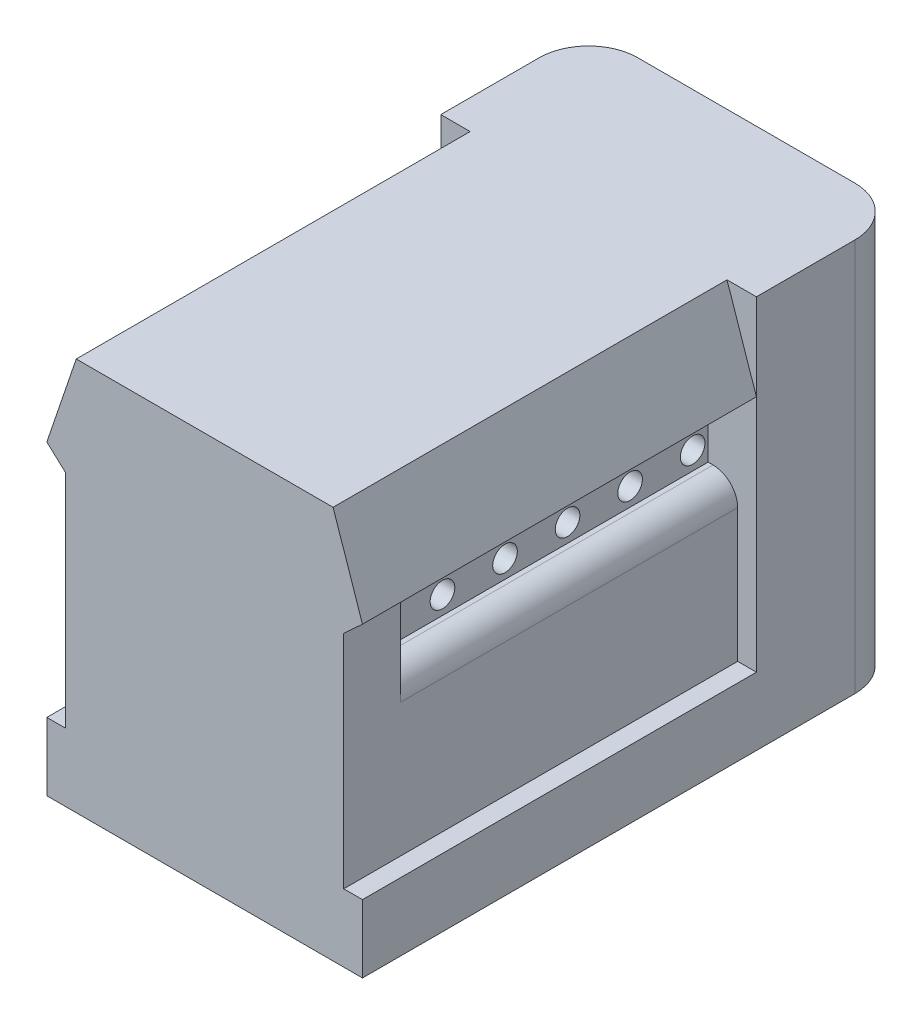
ISO-10303-21;
HEADER;
FILE_DESCRIPTION(('STEP AP214'),'2;1');
FILE_NAME('part.step','',(''),(''),'','','');
FILE_SCHEMA(('AUTOMOTIVE_DESIGN { 1 0 10303 214 1 1 1 1 }'));
ENDSEC;
DATA;
#1=APPLICATION_CONTEXT('core data for automotive mechanical design processes');
#2=APPLICATION_PROTOCOL_DEFINITION('international standard','automotive_design',2000,#1);
#3=PRODUCT_CONTEXT('',#1,'mechanical');
#4=PRODUCT('Part','Part','',(#3));
#5=PRODUCT_RELATED_PRODUCT_CATEGORY('part','',(#4));
#6=PRODUCT_DEFINITION_FORMATION('','',#4);
#7=PRODUCT_DEFINITION_CONTEXT('part definition',#1,'design');
#8=PRODUCT_DEFINITION('design','',#6,#7);
#9=PRODUCT_DEFINITION_SHAPE('','',#8);
#10=(LENGTH_UNIT() NAMED_UNIT(*) SI_UNIT(.MILLI.,.METRE.));
#11=(NAMED_UNIT(*) PLANE_ANGLE_UNIT() SI_UNIT($,.RADIAN.));
#12=(NAMED_UNIT(*) SI_UNIT($,.STERADIAN.) SOLID_ANGLE_UNIT());
#13=UNCERTAINTY_MEASURE_WITH_UNIT(LENGTH_MEASURE(1.E-05),#10,'distance_accuracy_value','');
#14=(GEOMETRIC_REPRESENTATION_CONTEXT(3) GLOBAL_UNCERTAINTY_ASSIGNED_CONTEXT((#13)) GLOBAL_UNIT_ASSIGNED_CONTEXT((#10,
#11,#12)) REPRESENTATION_CONTEXT('',''));
#15=CARTESIAN_POINT('',(0.,0.,0.));
#16=DIRECTION('',(0.,0.,1.));
#17=DIRECTION('',(1.,0.,0.));
#18=AXIS2_PLACEMENT_3D('',#15,#16,#17);
#19=CARTESIAN_POINT('',(0.,0.,16.));
#20=DIRECTION('',(0.,1.,0.));
#21=DIRECTION('',(-1.,0.,0.));
#22=AXIS2_PLACEMENT_3D('',#19,#20,#21);
#23=PLANE('',#22);
#24=CARTESIAN_POINT('',(-2.5476427621849,0.,-4.45));
#25=DIRECTION('',(0.,1.,0.));
#26=DIRECTION('',(-1.,0.,0.));
#27=AXIS2_PLACEMENT_3D('',#24,#25,#26);
#28=CIRCLE('',#27,0.4);
#29=CARTESIAN_POINT('',(-2.9476427621849,0.,-4.45));
#30=VERTEX_POINT('',#29);
#31=EDGE_CURVE('E40',#30,#30,#28,.F.);
#32=ORIENTED_EDGE('',*,*,#31,.F.);
#33=EDGE_LOOP('',(#32));
#34=FACE_BOUND('',#33,.T.);
#35=DIRECTION('',(0.,0.,-1.));
#36=VECTOR('',#35,1.);
#37=CARTESIAN_POINT('',(6.41,0.,16.));
#38=LINE('',#37,#36);
#39=CARTESIAN_POINT('',(6.41,0.,16.));
#40=VERTEX_POINT('',#39);
#41=CARTESIAN_POINT('',(6.41,0.,-4.));
#42=VERTEX_POINT('',#41);
#43=EDGE_CURVE('E371',#40,#42,#38,.T.);
#44=ORIENTED_EDGE('',*,*,#43,.F.);
#45=DIRECTION('',(1.,0.,0.));
#46=VECTOR('',#45,1.);
#47=CARTESIAN_POINT('',(0.,0.,16.));
#48=LINE('',#47,#46);
#49=CARTESIAN_POINT('',(-6.41,0.,16.));
#50=VERTEX_POINT('',#49);
#51=EDGE_CURVE('E304',#50,#40,#48,.T.);
#52=ORIENTED_EDGE('',*,*,#51,.F.);
#53=DIRECTION('',(0.,0.,-1.));
#54=VECTOR('',#53,1.);
#55=CARTESIAN_POINT('',(-6.41,0.,16.));
#56=LINE('',#55,#54);
#57=CARTESIAN_POINT('',(-6.41,0.,-4.));
#58=VERTEX_POINT('',#57);
#59=EDGE_CURVE('E330',#50,#58,#56,.T.);
#60=ORIENTED_EDGE('',*,*,#59,.T.);
#61=CARTESIAN_POINT('',(-4.41,0.,-4.));
#62=DIRECTION('',(0.,1.,0.));
#63=DIRECTION('',(-1.,0.,0.));
#64=AXIS2_PLACEMENT_3D('',#61,#62,#63);
#65=CIRCLE('',#64,2.);
#66=CARTESIAN_POINT('',(-4.41,0.,-6.));
#67=VERTEX_POINT('',#66);
#68=EDGE_CURVE('E253',#58,#67,#65,.F.);
#69=ORIENTED_EDGE('',*,*,#68,.T.);
#70=DIRECTION('',(1.,0.,0.));
#71=VECTOR('',#70,1.);
#72=CARTESIAN_POINT('',(-4.41,0.,-6.));
#73=LINE('',#72,#71);
#74=CARTESIAN_POINT('',(4.41,0.,-6.));
#75=VERTEX_POINT('',#74);
#76=EDGE_CURVE('E251',#67,#75,#73,.T.);
#77=ORIENTED_EDGE('',*,*,#76,.T.);
#78=CARTESIAN_POINT('',(4.41,0.,-4.));
#79=DIRECTION('',(0.,1.,0.));
#80=DIRECTION('',(-1.,0.,0.));
#81=AXIS2_PLACEMENT_3D('',#78,#79,#80);
#82=CIRCLE('',#81,2.);
#83=EDGE_CURVE('E256',#75,#42,#82,.F.);
#84=ORIENTED_EDGE('',*,*,#83,.T.);
#85=EDGE_LOOP('',(#44,#52,#60,#69,#77,#84));
#86=FACE_BOUND('',#85,.T.);
#87=CARTESIAN_POINT('',(-0.00764276218490068,0.,-4.45));
#88=DIRECTION('',(0.,1.,0.));
#89=DIRECTION('',(-1.,0.,0.));
#90=AXIS2_PLACEMENT_3D('',#87,#88,#89);
#91=CIRCLE('',#90,0.4);
#92=CARTESIAN_POINT('',(-0.407642762184901,0.,-4.45));
#93=VERTEX_POINT('',#92);
#94=EDGE_CURVE('E393',#93,#93,#91,.F.);
#95=ORIENTED_EDGE('',*,*,#94,.F.);
#96=EDGE_LOOP('',(#95));
#97=FACE_BOUND('',#96,.T.);
#98=CARTESIAN_POINT('',(2.5476427621849,0.,-4.45));
#99=DIRECTION('',(0.,1.,0.));
#100=DIRECTION('',(-1.,0.,0.));
#101=AXIS2_PLACEMENT_3D('',#98,#99,#100);
#102=CIRCLE('',#101,0.4);
#103=CARTESIAN_POINT('',(2.1476427621849,0.,-4.45));
#104=VERTEX_POINT('',#103);
#105=EDGE_CURVE('E11',#104,#104,#102,.F.);
#106=ORIENTED_EDGE('',*,*,#105,.F.);
#107=EDGE_LOOP('',(#106));
#108=FACE_BOUND('',#107,.T.);
#109=ADVANCED_FACE('F32',(#34,#86,#97,#108),#23,.F.);
#110=CARTESIAN_POINT('',(6.41,0.,16.));
#111=DIRECTION('',(-1.,0.,0.));
#112=DIRECTION('',(0.,-1.,0.));
#113=AXIS2_PLACEMENT_3D('',#110,#111,#112);
#114=PLANE('',#113);
#115=ORIENTED_EDGE('',*,*,#43,.T.);
#116=DIRECTION('',(0.,1.,0.));
#117=VECTOR('',#116,1.);
#118=CARTESIAN_POINT('',(6.41,-14.1545893617583,-4.));
#119=LINE('',#118,#117);
#120=CARTESIAN_POINT('',(6.41,15.9608859734106,-4.));
#121=VERTEX_POINT('',#120);
#122=EDGE_CURVE('E283',#42,#121,#119,.T.);
#123=ORIENTED_EDGE('',*,*,#122,.T.);
#124=DIRECTION('',(0.,0.,-1.));
#125=VECTOR('',#124,1.);
#126=CARTESIAN_POINT('',(6.41,15.9608859734106,0.));
#127=LINE('',#126,#125);
#128=CARTESIAN_POINT('',(6.41,15.9608859734106,0.));
#129=VERTEX_POINT('',#128);
#130=EDGE_CURVE('E250',#129,#121,#127,.T.);
#131=ORIENTED_EDGE('',*,*,#130,.F.);
#132=DIRECTION('',(0.,1.,0.));
#133=VECTOR('',#132,1.);
#134=CARTESIAN_POINT('',(6.41,-14.1545893617583,0.));
#135=LINE('',#134,#133);
#136=CARTESIAN_POINT('',(6.41,12.4441681952855,0.));
#137=VERTEX_POINT('',#136);
#138=EDGE_CURVE('E284',#137,#129,#135,.T.);
#139=ORIENTED_EDGE('',*,*,#138,.F.);
#140=CARTESIAN_POINT('',(6.41,2.75660601403546,0.));
#141=VERTEX_POINT('',#140);
#142=EDGE_CURVE('E254',#141,#137,#135,.T.);
#143=ORIENTED_EDGE('',*,*,#142,.F.);
#144=DIRECTION('',(0.,0.,-1.));
#145=VECTOR('',#144,1.);
#146=CARTESIAN_POINT('',(6.41,2.75660601403546,16.));
#147=LINE('',#146,#145);
#148=CARTESIAN_POINT('',(6.41,2.75660601403546,16.));
#149=VERTEX_POINT('',#148);
#150=EDGE_CURVE('E368',#149,#141,#147,.T.);
#151=ORIENTED_EDGE('',*,*,#150,.F.);
#152=DIRECTION('',(0.,1.,0.));
#153=VECTOR('',#152,1.);
#154=CARTESIAN_POINT('',(6.41,0.,16.));
#155=LINE('',#154,#153);
#156=EDGE_CURVE('E306',#40,#149,#155,.T.);
#157=ORIENTED_EDGE('',*,*,#156,.F.);
#158=EDGE_LOOP('',(#115,#123,#131,#139,#143,#151,#157));
#159=FACE_BOUND('',#158,.T.);
#160=ADVANCED_FACE('F402',(#159),#114,.F.);
#161=CARTESIAN_POINT('',(6.41,2.75660601403546,16.));
#162=DIRECTION('',(0.,-1.,0.));
#163=DIRECTION('',(0.,0.,-1.));
#164=AXIS2_PLACEMENT_3D('',#161,#162,#163);
#165=PLANE('',#164);
#166=DIRECTION('',(-1.,0.,0.));
#167=VECTOR('',#166,1.);
#168=CARTESIAN_POINT('',(6.41,2.75660601403546,0.));
#169=LINE('',#168,#167);
#170=CARTESIAN_POINT('',(5.64930017042915,2.75660601403546,0.));
#171=VERTEX_POINT('',#170);
#172=EDGE_CURVE('E292',#141,#171,#169,.T.);
#173=ORIENTED_EDGE('',*,*,#172,.T.);
#174=DIRECTION('',(0.,0.,-1.));
#175=VECTOR('',#174,1.);
#176=CARTESIAN_POINT('',(5.64930017042915,2.75660601403546,16.));
#177=LINE('',#176,#175);
#178=CARTESIAN_POINT('',(5.64930017042915,2.75660601403546,16.));
#179=VERTEX_POINT('',#178);
#180=EDGE_CURVE('E372',#179,#171,#177,.T.);
#181=ORIENTED_EDGE('',*,*,#180,.F.);
#182=DIRECTION('',(-1.,0.,0.));
#183=VECTOR('',#182,1.);
#184=CARTESIAN_POINT('',(6.41,2.75660601403546,16.));
#185=LINE('',#184,#183);
#186=EDGE_CURVE('E309',#149,#179,#185,.T.);
#187=ORIENTED_EDGE('',*,*,#186,.F.);
#188=ORIENTED_EDGE('',*,*,#150,.T.);
#189=EDGE_LOOP('',(#173,#181,#187,#188));
#190=FACE_BOUND('',#189,.T.);
#191=ADVANCED_FACE('F526',(#190),#165,.F.);
#192=CARTESIAN_POINT('',(5.64930017042915,8.1646618499226,16.));
#193=DIRECTION('',(-1.,0.,0.));
#194=DIRECTION('',(0.,0.,1.));
#195=AXIS2_PLACEMENT_3D('',#192,#193,#194);
#196=PLANE('',#195);
#197=DIRECTION('',(0.,0.,-1.));
#198=VECTOR('',#197,1.);
#199=CARTESIAN_POINT('',(5.64930017042914,8.1646618499226,16.));
#200=LINE('',#199,#198);
#201=CARTESIAN_POINT('',(5.64930017042914,8.1646618499226,13.7));
#202=VERTEX_POINT('',#201);
#203=CARTESIAN_POINT('',(5.64930017042914,8.1646618499226,0.));
#204=VERTEX_POINT('',#203);
#205=EDGE_CURVE('E213',#202,#204,#200,.T.);
#206=ORIENTED_EDGE('',*,*,#205,.F.);
#207=DIRECTION('',(0.,-1.,0.));
#208=VECTOR('',#207,1.);
#209=CARTESIAN_POINT('',(5.64930017042914,13.,13.7));
#210=LINE('',#209,#208);
#211=CARTESIAN_POINT('',(5.64930017042914,11.7445753651986,13.7));
#212=VERTEX_POINT('',#211);
#213=EDGE_CURVE('E198',#212,#202,#210,.T.);
#214=ORIENTED_EDGE('',*,*,#213,.F.);
#215=DIRECTION('',(0.,0.,-1.));
#216=VECTOR('',#215,1.);
#217=CARTESIAN_POINT('',(5.64930017042914,11.7445753651986,16.));
#218=LINE('',#217,#216);
#219=CARTESIAN_POINT('',(5.64930017042914,11.7445753651986,16.));
#220=VERTEX_POINT('',#219);
#221=EDGE_CURVE('E210',#220,#212,#218,.T.);
#222=ORIENTED_EDGE('',*,*,#221,.F.);
#223=DIRECTION('',(0.,1.,0.));
#224=VECTOR('',#223,1.);
#225=CARTESIAN_POINT('',(5.64930017042915,8.1646618499226,16.));
#226=LINE('',#225,#224);
#227=EDGE_CURVE('E311',#179,#220,#226,.T.);
#228=ORIENTED_EDGE('',*,*,#227,.F.);
#229=ORIENTED_EDGE('',*,*,#180,.T.);
#230=DIRECTION('',(0.,1.,0.));
#231=VECTOR('',#230,1.);
#232=CARTESIAN_POINT('',(5.64930017042915,8.1646618499226,0.));
#233=LINE('',#232,#231);
#234=EDGE_CURVE('E331',#171,#204,#233,.T.);
#235=ORIENTED_EDGE('',*,*,#234,.T.);
#236=EDGE_LOOP('',(#206,#214,#222,#228,#229,#235));
#237=FACE_BOUND('',#236,.T.);
#238=ADVANCED_FACE('F208',(#237),#196,.F.);
#239=CARTESIAN_POINT('',(4.64930017042914,8.1646618499226,16.));
#240=DIRECTION('',(0.,0.,-1.));
#241=DIRECTION('',(-1.,0.,0.));
#242=AXIS2_PLACEMENT_3D('',#239,#240,#241);
#243=CYLINDRICAL_SURFACE('',#242,1.);
#244=CARTESIAN_POINT('',(4.64930017042914,8.1646618499226,13.7));
#245=DIRECTION('',(0.,0.,-1.));
#246=DIRECTION('',(-1.,0.,0.));
#247=AXIS2_PLACEMENT_3D('',#244,#245,#246);
#248=CIRCLE('',#247,1.);
#249=CARTESIAN_POINT('',(4.64930017042914,9.16466184992259,13.7));
#250=VERTEX_POINT('',#249);
#251=EDGE_CURVE('E236',#250,#202,#248,.T.);
#252=ORIENTED_EDGE('',*,*,#251,.T.);
#253=ORIENTED_EDGE('',*,*,#205,.T.);
#254=CARTESIAN_POINT('',(4.64930017042914,8.1646618499226,0.));
#255=DIRECTION('',(0.,0.,1.));
#256=DIRECTION('',(-1.,0.,0.));
#257=AXIS2_PLACEMENT_3D('',#254,#255,#256);
#258=CIRCLE('',#257,1.);
#259=CARTESIAN_POINT('',(4.64930017042914,9.16466184992259,0.));
#260=VERTEX_POINT('',#259);
#261=EDGE_CURVE('E333',#204,#260,#258,.T.);
#262=ORIENTED_EDGE('',*,*,#261,.T.);
#263=DIRECTION('',(0.,0.,-1.));
#264=VECTOR('',#263,1.);
#265=CARTESIAN_POINT('',(4.64930017042914,9.16466184992259,16.));
#266=LINE('',#265,#264);
#267=EDGE_CURVE('E580',#250,#260,#266,.T.);
#268=ORIENTED_EDGE('',*,*,#267,.F.);
#269=EDGE_LOOP('',(#252,#253,#262,#268));
#270=FACE_BOUND('',#269,.T.);
#271=ADVANCED_FACE('F519',(#270),#243,.T.);
#272=CARTESIAN_POINT('',(4.44930017042915,9.16466184992259,16.));
#273=DIRECTION('',(0.,-1.,0.));
#274=DIRECTION('',(0.,0.,-1.));
#275=AXIS2_PLACEMENT_3D('',#272,#273,#274);
#276=PLANE('',#275);
#277=DIRECTION('',(0.,0.,-1.));
#278=VECTOR('',#277,1.);
#279=CARTESIAN_POINT('',(4.44930017042915,9.16466184992259,16.));
#280=LINE('',#279,#278);
#281=CARTESIAN_POINT('',(4.44930017042915,9.16466184992259,13.7));
#282=VERTEX_POINT('',#281);
#283=CARTESIAN_POINT('',(4.44930017042915,9.16466184992259,0.));
#284=VERTEX_POINT('',#283);
#285=EDGE_CURVE('E578',#282,#284,#280,.T.);
#286=ORIENTED_EDGE('',*,*,#285,.F.);
#287=DIRECTION('',(1.,0.,0.));
#288=VECTOR('',#287,1.);
#289=CARTESIAN_POINT('',(4.44930017042915,9.16466184992259,13.7));
#290=LINE('',#289,#288);
#291=EDGE_CURVE('E233',#282,#250,#290,.T.);
#292=ORIENTED_EDGE('',*,*,#291,.T.);
#293=ORIENTED_EDGE('',*,*,#267,.T.);
#294=DIRECTION('',(-1.,0.,0.));
#295=VECTOR('',#294,1.);
#296=CARTESIAN_POINT('',(4.44930017042915,9.16466184992259,0.));
#297=LINE('',#296,#295);
#298=EDGE_CURVE('E336',#260,#284,#297,.T.);
#299=ORIENTED_EDGE('',*,*,#298,.T.);
#300=EDGE_LOOP('',(#286,#292,#293,#299));
#301=FACE_BOUND('',#300,.T.);
#302=ADVANCED_FACE('F515',(#301),#276,.F.);
#303=CARTESIAN_POINT('',(4.44930017042915,10.6409713370789,16.));
#304=DIRECTION('',(-1.,0.,0.));
#305=DIRECTION('',(0.,0.,1.));
#306=AXIS2_PLACEMENT_3D('',#303,#304,#305);
#307=PLANE('',#306);
#308=CARTESIAN_POINT('',(4.44930017042915,9.90281659350076,3.17));
#309=DIRECTION('',(-1.,0.,0.));
#310=DIRECTION('',(0.,0.,1.));
#311=AXIS2_PLACEMENT_3D('',#308,#309,#310);
#312=CIRCLE('',#311,0.5);
#313=CARTESIAN_POINT('',(4.44930017042915,9.90281659350076,3.67));
#314=VERTEX_POINT('',#313);
#315=EDGE_CURVE('E241',#314,#314,#312,.F.);
#316=ORIENTED_EDGE('',*,*,#315,.F.);
#317=EDGE_LOOP('',(#316));
#318=FACE_BOUND('',#317,.T.);
#319=CARTESIAN_POINT('',(4.44930017042915,9.90281659350076,0.63));
#320=DIRECTION('',(-1.,0.,0.));
#321=DIRECTION('',(0.,0.,1.));
#322=AXIS2_PLACEMENT_3D('',#319,#320,#321);
#323=CIRCLE('',#322,0.5);
#324=CARTESIAN_POINT('',(4.44930017042915,9.90281659350076,1.13));
#325=VERTEX_POINT('',#324);
#326=EDGE_CURVE('E247',#325,#325,#323,.F.);
#327=ORIENTED_EDGE('',*,*,#326,.F.);
#328=EDGE_LOOP('',(#327));
#329=FACE_BOUND('',#328,.T.);
#330=DIRECTION('',(0.,0.,-1.));
#331=VECTOR('',#330,1.);
#332=CARTESIAN_POINT('',(4.44930017042915,10.6409713370789,16.));
#333=LINE('',#332,#331);
#334=CARTESIAN_POINT('',(4.44930017042915,10.6409713370789,13.7));
#335=VERTEX_POINT('',#334);
#336=CARTESIAN_POINT('',(4.44930017042915,10.6409713370789,0.));
#337=VERTEX_POINT('',#336);
#338=EDGE_CURVE('E576',#335,#337,#333,.T.);
#339=ORIENTED_EDGE('',*,*,#338,.F.);
#340=DIRECTION('',(0.,-1.,0.));
#341=VECTOR('',#340,1.);
#342=CARTESIAN_POINT('',(4.44930017042915,10.6409713370789,13.7));
#343=LINE('',#342,#341);
#344=EDGE_CURVE('E201',#335,#282,#343,.T.);
#345=ORIENTED_EDGE('',*,*,#344,.T.);
#346=ORIENTED_EDGE('',*,*,#285,.T.);
#347=DIRECTION('',(0.,1.,0.));
#348=VECTOR('',#347,1.);
#349=CARTESIAN_POINT('',(4.44930017042915,10.6409713370789,0.));
#350=LINE('',#349,#348);
#351=EDGE_CURVE('E339',#284,#337,#350,.T.);
#352=ORIENTED_EDGE('',*,*,#351,.T.);
#353=EDGE_LOOP('',(#339,#345,#346,#352));
#354=FACE_BOUND('',#353,.T.);
#355=CARTESIAN_POINT('',(4.44930017042915,9.90281659350076,5.71));
#356=DIRECTION('',(-1.,0.,0.));
#357=DIRECTION('',(0.,0.,1.));
#358=AXIS2_PLACEMENT_3D('',#355,#356,#357);
#359=CIRCLE('',#358,0.5);
#360=CARTESIAN_POINT('',(4.44930017042915,9.90281659350076,6.21));
#361=VERTEX_POINT('',#360);
#362=EDGE_CURVE('E378',#361,#361,#359,.F.);
#363=ORIENTED_EDGE('',*,*,#362,.F.);
#364=EDGE_LOOP('',(#363));
#365=FACE_BOUND('',#364,.T.);
#366=CARTESIAN_POINT('',(4.44930017042915,9.90281659350076,8.25));
#367=DIRECTION('',(-1.,0.,0.));
#368=DIRECTION('',(0.,0.,1.));
#369=AXIS2_PLACEMENT_3D('',#366,#367,#368);
#370=CIRCLE('',#369,0.5);
#371=CARTESIAN_POINT('',(4.44930017042915,9.90281659350076,8.75));
#372=VERTEX_POINT('',#371);
#373=EDGE_CURVE('E384',#372,#372,#370,.F.);
#374=ORIENTED_EDGE('',*,*,#373,.F.);
#375=EDGE_LOOP('',(#374));
#376=FACE_BOUND('',#375,.T.);
#377=CARTESIAN_POINT('',(4.44930017042915,9.90281659350076,10.79));
#378=DIRECTION('',(-1.,0.,0.));
#379=DIRECTION('',(0.,0.,1.));
#380=AXIS2_PLACEMENT_3D('',#377,#378,#379);
#381=CIRCLE('',#380,0.5);
#382=CARTESIAN_POINT('',(4.44930017042915,9.90281659350076,11.29));
#383=VERTEX_POINT('',#382);
#384=EDGE_CURVE('E390',#383,#383,#381,.F.);
#385=ORIENTED_EDGE('',*,*,#384,.F.);
#386=EDGE_LOOP('',(#385));
#387=FACE_BOUND('',#386,.T.);
#388=ADVANCED_FACE('F512',(#318,#329,#354,#365,#376,#387),#307,.F.);
#389=CARTESIAN_POINT('',(4.44930017042915,10.6409713370789,16.));
#390=DIRECTION('',(-0.676924977588465,0.736052019029129,0.));
#391=DIRECTION('',(-0.736052019029129,-0.676924977588465,0.));
#392=AXIS2_PLACEMENT_3D('',#389,#390,#391);
#393=PLANE('',#392);
#394=DIRECTION('',(0.736052019029129,0.676924977588465,0.));
#395=VECTOR('',#394,1.);
#396=CARTESIAN_POINT('',(4.44930017042915,10.6409713370789,16.));
#397=LINE('',#396,#395);
#398=CARTESIAN_POINT('',(6.41,12.4441681952855,16.));
#399=VERTEX_POINT('',#398);
#400=EDGE_CURVE('E218',#220,#399,#397,.T.);
#401=ORIENTED_EDGE('',*,*,#400,.F.);
#402=ORIENTED_EDGE('',*,*,#221,.T.);
#403=DIRECTION('',(-0.736052019029129,-0.676924977588465,0.));
#404=VECTOR('',#403,1.);
#405=CARTESIAN_POINT('',(4.44930017042915,10.6409713370789,13.7));
#406=LINE('',#405,#404);
#407=EDGE_CURVE('E195',#212,#335,#406,.T.);
#408=ORIENTED_EDGE('',*,*,#407,.T.);
#409=ORIENTED_EDGE('',*,*,#338,.T.);
#410=DIRECTION('',(0.736052019029129,0.676924977588465,0.));
#411=VECTOR('',#410,1.);
#412=CARTESIAN_POINT('',(4.44930017042915,10.6409713370789,0.));
#413=LINE('',#412,#411);
#414=EDGE_CURVE('E342',#337,#137,#413,.T.);
#415=ORIENTED_EDGE('',*,*,#414,.T.);
#416=DIRECTION('',(0.,0.,-1.));
#417=VECTOR('',#416,1.);
#418=CARTESIAN_POINT('',(6.41,12.4441681952855,16.));
#419=LINE('',#418,#417);
#420=EDGE_CURVE('E360',#399,#137,#419,.T.);
#421=ORIENTED_EDGE('',*,*,#420,.F.);
#422=EDGE_LOOP('',(#401,#402,#408,#409,#415,#421));
#423=FACE_BOUND('',#422,.T.);
#424=ADVANCED_FACE('F216',(#423),#393,.F.);
#425=CARTESIAN_POINT('',(6.41,12.4441681952855,16.));
#426=DIRECTION('',(-0.946881588720455,-0.32158242635789,0.));
#427=DIRECTION('',(0.32158242635789,-0.946881588720455,0.));
#428=AXIS2_PLACEMENT_3D('',#425,#426,#427);
#429=PLANE('',#428);
#430=DIRECTION('',(-0.32158242635789,0.946881588720455,0.));
#431=VECTOR('',#430,1.);
#432=CARTESIAN_POINT('',(6.41,12.4441681952855,0.));
#433=LINE('',#432,#431);
#434=CARTESIAN_POINT('',(5.21564301874999,15.9608859734106,0.));
#435=VERTEX_POINT('',#434);
#436=EDGE_CURVE('E345',#137,#435,#433,.T.);
#437=ORIENTED_EDGE('',*,*,#436,.T.);
#438=DIRECTION('',(0.,0.,-1.));
#439=VECTOR('',#438,1.);
#440=CARTESIAN_POINT('',(5.21564301874999,15.9608859734106,16.));
#441=LINE('',#440,#439);
#442=CARTESIAN_POINT('',(5.21564301874999,15.9608859734106,16.));
#443=VERTEX_POINT('',#442);
#444=EDGE_CURVE('E357',#443,#435,#441,.T.);
#445=ORIENTED_EDGE('',*,*,#444,.F.);
#446=DIRECTION('',(-0.32158242635789,0.946881588720455,0.));
#447=VECTOR('',#446,1.);
#448=CARTESIAN_POINT('',(6.41,12.4441681952855,16.));
#449=LINE('',#448,#447);
#450=EDGE_CURVE('E314',#399,#443,#449,.T.);
#451=ORIENTED_EDGE('',*,*,#450,.F.);
#452=ORIENTED_EDGE('',*,*,#420,.T.);
#453=EDGE_LOOP('',(#437,#445,#451,#452));
#454=FACE_BOUND('',#453,.T.);
#455=ADVANCED_FACE('F505',(#454),#429,.F.);
#456=CARTESIAN_POINT('',(-5.21564301874999,15.9608859734106,16.));
#457=DIRECTION('',(0.,-1.,0.));
#458=DIRECTION('',(0.,0.,-1.));
#459=AXIS2_PLACEMENT_3D('',#456,#457,#458);
#460=PLANE('',#459);
#461=ORIENTED_EDGE('',*,*,#444,.T.);
#462=DIRECTION('',(1.,0.,0.));
#463=VECTOR('',#462,1.);
#464=CARTESIAN_POINT('',(-6.41,15.9608859734106,0.));
#465=LINE('',#464,#463);
#466=EDGE_CURVE('E271',#435,#129,#465,.T.);
#467=ORIENTED_EDGE('',*,*,#466,.T.);
#468=ORIENTED_EDGE('',*,*,#130,.T.);
#469=CARTESIAN_POINT('',(4.41,15.9608859734106,-4.));
#470=DIRECTION('',(0.,1.,0.));
#471=DIRECTION('',(0.,0.,-1.));
#472=AXIS2_PLACEMENT_3D('',#469,#470,#471);
#473=CIRCLE('',#472,2.);
#474=CARTESIAN_POINT('',(4.41,15.9608859734106,-6.));
#475=VERTEX_POINT('',#474);
#476=EDGE_CURVE('E259',#121,#475,#473,.T.);
#477=ORIENTED_EDGE('',*,*,#476,.T.);
#478=DIRECTION('',(-1.,0.,0.));
#479=VECTOR('',#478,1.);
#480=CARTESIAN_POINT('',(-4.41,15.9608859734106,-6.));
#481=LINE('',#480,#479);
#482=CARTESIAN_POINT('',(-4.41,15.9608859734106,-6.));
#483=VERTEX_POINT('',#482);
#484=EDGE_CURVE('E262',#475,#483,#481,.T.);
#485=ORIENTED_EDGE('',*,*,#484,.T.);
#486=CARTESIAN_POINT('',(-4.41,15.9608859734106,-4.));
#487=DIRECTION('',(0.,1.,0.));
#488=DIRECTION('',(0.,0.,1.));
#489=AXIS2_PLACEMENT_3D('',#486,#487,#488);
#490=CIRCLE('',#489,2.);
#491=CARTESIAN_POINT('',(-6.41,15.9608859734106,-4.));
#492=VERTEX_POINT('',#491);
#493=EDGE_CURVE('E265',#483,#492,#490,.T.);
#494=ORIENTED_EDGE('',*,*,#493,.T.);
#495=DIRECTION('',(0.,0.,1.));
#496=VECTOR('',#495,1.);
#497=CARTESIAN_POINT('',(-6.41,15.9608859734106,0.));
#498=LINE('',#497,#496);
#499=CARTESIAN_POINT('',(-6.41,15.9608859734106,0.));
#500=VERTEX_POINT('',#499);
#501=EDGE_CURVE('E268',#492,#500,#498,.T.);
#502=ORIENTED_EDGE('',*,*,#501,.T.);
#503=CARTESIAN_POINT('',(-5.21564301874999,15.9608859734106,0.));
#504=VERTEX_POINT('',#503);
#505=EDGE_CURVE('E280',#500,#504,#465,.T.);
#506=ORIENTED_EDGE('',*,*,#505,.T.);
#507=DIRECTION('',(0.,0.,-1.));
#508=VECTOR('',#507,1.);
#509=CARTESIAN_POINT('',(-5.21564301874999,15.9608859734106,16.));
#510=LINE('',#509,#508);
#511=CARTESIAN_POINT('',(-5.21564301874999,15.9608859734106,16.));
#512=VERTEX_POINT('',#511);
#513=EDGE_CURVE('E361',#512,#504,#510,.T.);
#514=ORIENTED_EDGE('',*,*,#513,.F.);
#515=DIRECTION('',(-1.,0.,0.));
#516=VECTOR('',#515,1.);
#517=CARTESIAN_POINT('',(-5.21564301874999,15.9608859734106,16.));
#518=LINE('',#517,#516);
#519=EDGE_CURVE('E316',#443,#512,#518,.T.);
#520=ORIENTED_EDGE('',*,*,#519,.F.);
#521=EDGE_LOOP('',(#461,#467,#468,#477,#485,#494,#502,#506,#514,#520));
#522=FACE_BOUND('',#521,.T.);
#523=ADVANCED_FACE('F501',(#522),#460,.F.);
#524=CARTESIAN_POINT('',(-6.41,12.4441681952855,16.));
#525=DIRECTION('',(0.946881588720455,-0.32158242635789,0.));
#526=DIRECTION('',(0.32158242635789,0.946881588720455,0.));
#527=AXIS2_PLACEMENT_3D('',#524,#525,#526);
#528=PLANE('',#527);
#529=DIRECTION('',(-0.32158242635789,-0.946881588720455,0.));
#530=VECTOR('',#529,1.);
#531=CARTESIAN_POINT('',(-6.41,12.4441681952855,0.));
#532=LINE('',#531,#530);
#533=CARTESIAN_POINT('',(-6.41,12.4441681952855,0.));
#534=VERTEX_POINT('',#533);
#535=EDGE_CURVE('E354',#504,#534,#532,.T.);
#536=ORIENTED_EDGE('',*,*,#535,.T.);
#537=DIRECTION('',(0.,0.,-1.));
#538=VECTOR('',#537,1.);
#539=CARTESIAN_POINT('',(-6.41,12.4441681952855,16.));
#540=LINE('',#539,#538);
#541=CARTESIAN_POINT('',(-6.41,12.4441681952855,16.));
#542=VERTEX_POINT('',#541);
#543=EDGE_CURVE('E567',#542,#534,#540,.T.);
#544=ORIENTED_EDGE('',*,*,#543,.F.);
#545=DIRECTION('',(-0.32158242635789,-0.946881588720455,0.));
#546=VECTOR('',#545,1.);
#547=CARTESIAN_POINT('',(-6.41,12.4441681952855,16.));
#548=LINE('',#547,#546);
#549=EDGE_CURVE('E318',#512,#542,#548,.T.);
#550=ORIENTED_EDGE('',*,*,#549,.F.);
#551=ORIENTED_EDGE('',*,*,#513,.T.);
#552=EDGE_LOOP('',(#536,#544,#550,#551));
#553=FACE_BOUND('',#552,.T.);
#554=ADVANCED_FACE('F498',(#553),#528,.F.);
#555=CARTESIAN_POINT('',(-4.44930017042915,10.6409713370789,16.));
#556=DIRECTION('',(0.676924977588465,0.736052019029129,0.));
#557=DIRECTION('',(-0.736052019029129,0.676924977588465,0.));
#558=AXIS2_PLACEMENT_3D('',#555,#556,#557);
#559=PLANE('',#558);
#560=DIRECTION('',(-0.736052019029129,0.676924977588465,0.));
#561=VECTOR('',#560,1.);
#562=CARTESIAN_POINT('',(-4.44930017042915,10.6409713370789,13.7));
#563=LINE('',#562,#561);
#564=CARTESIAN_POINT('',(-4.44930017042915,10.6409713370789,13.7));
#565=VERTEX_POINT('',#564);
#566=CARTESIAN_POINT('',(-5.64930017042915,11.7445753651986,13.7));
#567=VERTEX_POINT('',#566);
#568=EDGE_CURVE('E47',#565,#567,#563,.T.);
#569=ORIENTED_EDGE('',*,*,#568,.T.);
#570=DIRECTION('',(0.,0.,1.));
#571=VECTOR('',#570,1.);
#572=CARTESIAN_POINT('',(-5.64930017042915,11.7445753651986,16.));
#573=LINE('',#572,#571);
#574=CARTESIAN_POINT('',(-5.64930017042915,11.7445753651986,16.));
#575=VERTEX_POINT('',#574);
#576=EDGE_CURVE('E219',#567,#575,#573,.T.);
#577=ORIENTED_EDGE('',*,*,#576,.T.);
#578=DIRECTION('',(0.736052019029129,-0.676924977588465,0.));
#579=VECTOR('',#578,1.);
#580=CARTESIAN_POINT('',(-4.44930017042915,10.6409713370789,16.));
#581=LINE('',#580,#579);
#582=EDGE_CURVE('E320',#542,#575,#581,.T.);
#583=ORIENTED_EDGE('',*,*,#582,.F.);
#584=ORIENTED_EDGE('',*,*,#543,.T.);
#585=DIRECTION('',(0.736052019029129,-0.676924977588465,0.));
#586=VECTOR('',#585,1.);
#587=CARTESIAN_POINT('',(-4.44930017042915,10.6409713370789,0.));
#588=LINE('',#587,#586);
#589=CARTESIAN_POINT('',(-4.44930017042915,10.6409713370789,0.));
#590=VERTEX_POINT('',#589);
#591=EDGE_CURVE('E348',#534,#590,#588,.T.);
#592=ORIENTED_EDGE('',*,*,#591,.T.);
#593=DIRECTION('',(0.,0.,-1.));
#594=VECTOR('',#593,1.);
#595=CARTESIAN_POINT('',(-4.44930017042915,10.6409713370789,16.));
#596=LINE('',#595,#594);
#597=EDGE_CURVE('E562',#565,#590,#596,.T.);
#598=ORIENTED_EDGE('',*,*,#597,.F.);
#599=EDGE_LOOP('',(#569,#577,#583,#584,#592,#598));
#600=FACE_BOUND('',#599,.T.);
#601=ADVANCED_FACE('F494',(#600),#559,.F.);
#602=CARTESIAN_POINT('',(-4.44930017042915,10.6409713370789,16.));
#603=DIRECTION('',(1.,0.,0.));
#604=DIRECTION('',(0.,0.,-1.));
#605=AXIS2_PLACEMENT_3D('',#602,#603,#604);
#606=PLANE('',#605);
#607=CARTESIAN_POINT('',(-4.44930017042915,9.90281659350076,3.17));
#608=DIRECTION('',(-1.,0.,0.));
#609=DIRECTION('',(0.,0.,1.));
#610=AXIS2_PLACEMENT_3D('',#607,#608,#609);
#611=CIRCLE('',#610,0.5);
#612=CARTESIAN_POINT('',(-4.44930017042915,9.90281659350076,3.67));
#613=VERTEX_POINT('',#612);
#614=EDGE_CURVE('E238',#613,#613,#611,.T.);
#615=ORIENTED_EDGE('',*,*,#614,.F.);
#616=EDGE_LOOP('',(#615));
#617=FACE_BOUND('',#616,.T.);
#618=CARTESIAN_POINT('',(-4.44930017042915,9.90281659350076,0.63));
#619=DIRECTION('',(-1.,0.,0.));
#620=DIRECTION('',(0.,0.,1.));
#621=AXIS2_PLACEMENT_3D('',#618,#619,#620);
#622=CIRCLE('',#621,0.5);
#623=CARTESIAN_POINT('',(-4.44930017042915,9.90281659350076,1.13));
#624=VERTEX_POINT('',#623);
#625=EDGE_CURVE('E244',#624,#624,#622,.T.);
#626=ORIENTED_EDGE('',*,*,#625,.F.);
#627=EDGE_LOOP('',(#626));
#628=FACE_BOUND('',#627,.T.);
#629=DIRECTION('',(0.,0.,-1.));
#630=VECTOR('',#629,1.);
#631=CARTESIAN_POINT('',(-4.44930017042915,9.16466184992259,16.));
#632=LINE('',#631,#630);
#633=CARTESIAN_POINT('',(-4.44930017042915,9.16466184992259,13.7));
#634=VERTEX_POINT('',#633);
#635=CARTESIAN_POINT('',(-4.44930017042915,9.16466184992259,0.));
#636=VERTEX_POINT('',#635);
#637=EDGE_CURVE('E564',#634,#636,#632,.T.);
#638=ORIENTED_EDGE('',*,*,#637,.F.);
#639=DIRECTION('',(0.,1.,0.));
#640=VECTOR('',#639,1.);
#641=CARTESIAN_POINT('',(-4.44930017042915,10.6409713370789,13.7));
#642=LINE('',#641,#640);
#643=EDGE_CURVE('E228',#634,#565,#642,.T.);
#644=ORIENTED_EDGE('',*,*,#643,.T.);
#645=ORIENTED_EDGE('',*,*,#597,.T.);
#646=DIRECTION('',(0.,-1.,0.));
#647=VECTOR('',#646,1.);
#648=CARTESIAN_POINT('',(-4.44930017042915,10.6409713370789,0.));
#649=LINE('',#648,#647);
#650=EDGE_CURVE('E609',#590,#636,#649,.T.);
#651=ORIENTED_EDGE('',*,*,#650,.T.);
#652=EDGE_LOOP('',(#638,#644,#645,#651));
#653=FACE_BOUND('',#652,.T.);
#654=CARTESIAN_POINT('',(-4.44930017042915,9.90281659350076,5.71));
#655=DIRECTION('',(-1.,0.,0.));
#656=DIRECTION('',(0.,0.,1.));
#657=AXIS2_PLACEMENT_3D('',#654,#655,#656);
#658=CIRCLE('',#657,0.5);
#659=CARTESIAN_POINT('',(-4.44930017042915,9.90281659350076,6.21));
#660=VERTEX_POINT('',#659);
#661=EDGE_CURVE('E375',#660,#660,#658,.T.);
#662=ORIENTED_EDGE('',*,*,#661,.F.);
#663=EDGE_LOOP('',(#662));
#664=FACE_BOUND('',#663,.T.);
#665=CARTESIAN_POINT('',(-4.44930017042915,9.90281659350076,8.25));
#666=DIRECTION('',(-1.,0.,0.));
#667=DIRECTION('',(0.,0.,1.));
#668=AXIS2_PLACEMENT_3D('',#665,#666,#667);
#669=CIRCLE('',#668,0.5);
#670=CARTESIAN_POINT('',(-4.44930017042915,9.90281659350076,8.75));
#671=VERTEX_POINT('',#670);
#672=EDGE_CURVE('E381',#671,#671,#669,.T.);
#673=ORIENTED_EDGE('',*,*,#672,.F.);
#674=EDGE_LOOP('',(#673));
#675=FACE_BOUND('',#674,.T.);
#676=CARTESIAN_POINT('',(-4.44930017042915,9.90281659350076,10.79));
#677=DIRECTION('',(-1.,0.,0.));
#678=DIRECTION('',(0.,0.,1.));
#679=AXIS2_PLACEMENT_3D('',#676,#677,#678);
#680=CIRCLE('',#679,0.5);
#681=CARTESIAN_POINT('',(-4.44930017042915,9.90281659350076,11.29));
#682=VERTEX_POINT('',#681);
#683=EDGE_CURVE('E387',#682,#682,#680,.T.);
#684=ORIENTED_EDGE('',*,*,#683,.F.);
#685=EDGE_LOOP('',(#684));
#686=FACE_BOUND('',#685,.T.);
#687=ADVANCED_FACE('F490',(#617,#628,#653,#664,#675,#686),#606,.F.);
#688=CARTESIAN_POINT('',(-4.44930017042915,9.16466184992259,16.));
#689=DIRECTION('',(0.,-1.,0.));
#690=DIRECTION('',(0.,0.,-1.));
#691=AXIS2_PLACEMENT_3D('',#688,#689,#690);
#692=PLANE('',#691);
#693=DIRECTION('',(0.,0.,-1.));
#694=VECTOR('',#693,1.);
#695=CARTESIAN_POINT('',(-4.64930017042914,9.1646618499226,16.));
#696=LINE('',#695,#694);
#697=CARTESIAN_POINT('',(-4.64930017042914,9.1646618499226,13.7));
#698=VERTEX_POINT('',#697);
#699=CARTESIAN_POINT('',(-4.64930017042914,9.1646618499226,0.));
#700=VERTEX_POINT('',#699);
#701=EDGE_CURVE('E570',#698,#700,#696,.T.);
#702=ORIENTED_EDGE('',*,*,#701,.F.);
#703=DIRECTION('',(1.,0.,0.));
#704=VECTOR('',#703,1.);
#705=CARTESIAN_POINT('',(-4.44930017042915,9.16466184992259,13.7));
#706=LINE('',#705,#704);
#707=EDGE_CURVE('E225',#698,#634,#706,.T.);
#708=ORIENTED_EDGE('',*,*,#707,.T.);
#709=ORIENTED_EDGE('',*,*,#637,.T.);
#710=DIRECTION('',(-1.,0.,0.));
#711=VECTOR('',#710,1.);
#712=CARTESIAN_POINT('',(-4.44930017042915,9.16466184992259,0.));
#713=LINE('',#712,#711);
#714=EDGE_CURVE('E607',#636,#700,#713,.T.);
#715=ORIENTED_EDGE('',*,*,#714,.T.);
#716=EDGE_LOOP('',(#702,#708,#709,#715));
#717=FACE_BOUND('',#716,.T.);
#718=ADVANCED_FACE('F486',(#717),#692,.F.);
#719=CARTESIAN_POINT('',(-4.64930017042914,8.1646618499226,16.));
#720=DIRECTION('',(0.,0.,-1.));
#721=DIRECTION('',(-1.,0.,0.));
#722=AXIS2_PLACEMENT_3D('',#719,#720,#721);
#723=CYLINDRICAL_SURFACE('',#722,1.);
#724=DIRECTION('',(0.,0.,-1.));
#725=VECTOR('',#724,1.);
#726=CARTESIAN_POINT('',(-5.64930017042915,8.1646618499226,16.));
#727=LINE('',#726,#725);
#728=CARTESIAN_POINT('',(-5.64930017042915,8.1646618499226,13.7));
#729=VERTEX_POINT('',#728);
#730=CARTESIAN_POINT('',(-5.64930017042915,8.1646618499226,0.));
#731=VERTEX_POINT('',#730);
#732=EDGE_CURVE('E598',#729,#731,#727,.T.);
#733=ORIENTED_EDGE('',*,*,#732,.F.);
#734=CARTESIAN_POINT('',(-4.64930017042914,8.1646618499226,13.7));
#735=DIRECTION('',(0.,0.,-1.));
#736=DIRECTION('',(-1.,0.,0.));
#737=AXIS2_PLACEMENT_3D('',#734,#735,#736);
#738=CIRCLE('',#737,1.);
#739=EDGE_CURVE('E55',#729,#698,#738,.T.);
#740=ORIENTED_EDGE('',*,*,#739,.T.);
#741=ORIENTED_EDGE('',*,*,#701,.T.);
#742=CARTESIAN_POINT('',(-4.64930017042914,8.1646618499226,0.));
#743=DIRECTION('',(0.,0.,1.));
#744=DIRECTION('',(1.,0.,0.));
#745=AXIS2_PLACEMENT_3D('',#742,#743,#744);
#746=CIRCLE('',#745,1.);
#747=EDGE_CURVE('E602',#700,#731,#746,.T.);
#748=ORIENTED_EDGE('',*,*,#747,.T.);
#749=EDGE_LOOP('',(#733,#740,#741,#748));
#750=FACE_BOUND('',#749,.T.);
#751=ADVANCED_FACE('F482',(#750),#723,.T.);
#752=CARTESIAN_POINT('',(-5.64930017042915,8.1646618499226,16.));
#753=DIRECTION('',(1.,0.,0.));
#754=DIRECTION('',(0.,0.,-1.));
#755=AXIS2_PLACEMENT_3D('',#752,#753,#754);
#756=PLANE('',#755);
#757=DIRECTION('',(0.,-1.,0.));
#758=VECTOR('',#757,1.);
#759=CARTESIAN_POINT('',(-5.64930017042915,8.1646618499226,0.));
#760=LINE('',#759,#758);
#761=CARTESIAN_POINT('',(-5.64930017042915,2.75660601403546,0.));
#762=VERTEX_POINT('',#761);
#763=EDGE_CURVE('E588',#731,#762,#760,.T.);
#764=ORIENTED_EDGE('',*,*,#763,.T.);
#765=DIRECTION('',(0.,0.,-1.));
#766=VECTOR('',#765,1.);
#767=CARTESIAN_POINT('',(-5.64930017042915,2.75660601403546,16.));
#768=LINE('',#767,#766);
#769=CARTESIAN_POINT('',(-5.64930017042915,2.75660601403546,16.));
#770=VERTEX_POINT('',#769);
#771=EDGE_CURVE('E596',#770,#762,#768,.T.);
#772=ORIENTED_EDGE('',*,*,#771,.F.);
#773=DIRECTION('',(0.,-1.,0.));
#774=VECTOR('',#773,1.);
#775=CARTESIAN_POINT('',(-5.64930017042915,8.1646618499226,16.));
#776=LINE('',#775,#774);
#777=EDGE_CURVE('E323',#575,#770,#776,.T.);
#778=ORIENTED_EDGE('',*,*,#777,.F.);
#779=ORIENTED_EDGE('',*,*,#576,.F.);
#780=DIRECTION('',(0.,-1.,0.));
#781=VECTOR('',#780,1.);
#782=CARTESIAN_POINT('',(-5.64930017042915,13.,13.7));
#783=LINE('',#782,#781);
#784=EDGE_CURVE('E214',#567,#729,#783,.T.);
#785=ORIENTED_EDGE('',*,*,#784,.T.);
#786=ORIENTED_EDGE('',*,*,#732,.T.);
#787=EDGE_LOOP('',(#764,#772,#778,#779,#785,#786));
#788=FACE_BOUND('',#787,.T.);
#789=ADVANCED_FACE('F478',(#788),#756,.F.);
#790=CARTESIAN_POINT('',(-6.41,2.75660601403546,16.));
#791=DIRECTION('',(0.,-1.,0.));
#792=DIRECTION('',(0.,0.,-1.));
#793=AXIS2_PLACEMENT_3D('',#790,#791,#792);
#794=PLANE('',#793);
#795=DIRECTION('',(-1.,0.,0.));
#796=VECTOR('',#795,1.);
#797=CARTESIAN_POINT('',(-6.41,2.75660601403546,0.));
#798=LINE('',#797,#796);
#799=CARTESIAN_POINT('',(-6.41,2.75660601403546,0.));
#800=VERTEX_POINT('',#799);
#801=EDGE_CURVE('E307',#762,#800,#798,.T.);
#802=ORIENTED_EDGE('',*,*,#801,.T.);
#803=DIRECTION('',(0.,0.,-1.));
#804=VECTOR('',#803,1.);
#805=CARTESIAN_POINT('',(-6.41,2.75660601403546,16.));
#806=LINE('',#805,#804);
#807=CARTESIAN_POINT('',(-6.41,2.75660601403546,16.));
#808=VERTEX_POINT('',#807);
#809=EDGE_CURVE('E589',#808,#800,#806,.T.);
#810=ORIENTED_EDGE('',*,*,#809,.F.);
#811=DIRECTION('',(-1.,0.,0.));
#812=VECTOR('',#811,1.);
#813=CARTESIAN_POINT('',(-6.41,2.75660601403546,16.));
#814=LINE('',#813,#812);
#815=EDGE_CURVE('E325',#770,#808,#814,.T.);
#816=ORIENTED_EDGE('',*,*,#815,.F.);
#817=ORIENTED_EDGE('',*,*,#771,.T.);
#818=EDGE_LOOP('',(#802,#810,#816,#817));
#819=FACE_BOUND('',#818,.T.);
#820=ADVANCED_FACE('F474',(#819),#794,.F.);
#821=CARTESIAN_POINT('',(-6.41,0.,16.));
#822=DIRECTION('',(1.,0.,0.));
#823=DIRECTION('',(0.,1.,0.));
#824=AXIS2_PLACEMENT_3D('',#821,#822,#823);
#825=PLANE('',#824);
#826=ORIENTED_EDGE('',*,*,#809,.T.);
#827=DIRECTION('',(0.,1.,0.));
#828=VECTOR('',#827,1.);
#829=CARTESIAN_POINT('',(-6.41,-14.1545893617583,0.));
#830=LINE('',#829,#828);
#831=EDGE_CURVE('E287',#800,#534,#830,.T.);
#832=ORIENTED_EDGE('',*,*,#831,.T.);
#833=EDGE_CURVE('E299',#534,#500,#830,.T.);
#834=ORIENTED_EDGE('',*,*,#833,.T.);
#835=ORIENTED_EDGE('',*,*,#501,.F.);
#836=DIRECTION('',(0.,1.,0.));
#837=VECTOR('',#836,1.);
#838=CARTESIAN_POINT('',(-6.41,-14.1545893617583,-4.));
#839=LINE('',#838,#837);
#840=EDGE_CURVE('E298',#58,#492,#839,.T.);
#841=ORIENTED_EDGE('',*,*,#840,.F.);
#842=ORIENTED_EDGE('',*,*,#59,.F.);
#843=DIRECTION('',(0.,-1.,0.));
#844=VECTOR('',#843,1.);
#845=CARTESIAN_POINT('',(-6.41,0.,16.));
#846=LINE('',#845,#844);
#847=EDGE_CURVE('E327',#808,#50,#846,.T.);
#848=ORIENTED_EDGE('',*,*,#847,.F.);
#849=EDGE_LOOP('',(#826,#832,#834,#835,#841,#842,#848));
#850=FACE_BOUND('',#849,.T.);
#851=ADVANCED_FACE('F469',(#850),#825,.F.);
#852=CARTESIAN_POINT('',(4.64930017042914,8.1646618499226,16.));
#853=DIRECTION('',(0.,0.,-1.));
#854=DIRECTION('',(-1.,0.,0.));
#855=AXIS2_PLACEMENT_3D('',#852,#853,#854);
#856=PLANE('',#855);
#857=ORIENTED_EDGE('',*,*,#227,.T.);
#858=ORIENTED_EDGE('',*,*,#400,.T.);
#859=ORIENTED_EDGE('',*,*,#450,.T.);
#860=ORIENTED_EDGE('',*,*,#519,.T.);
#861=ORIENTED_EDGE('',*,*,#549,.T.);
#862=ORIENTED_EDGE('',*,*,#582,.T.);
#863=ORIENTED_EDGE('',*,*,#777,.T.);
#864=ORIENTED_EDGE('',*,*,#815,.T.);
#865=ORIENTED_EDGE('',*,*,#847,.T.);
#866=ORIENTED_EDGE('',*,*,#51,.T.);
#867=ORIENTED_EDGE('',*,*,#156,.T.);
#868=ORIENTED_EDGE('',*,*,#186,.T.);
#869=EDGE_LOOP('',(#857,#858,#859,#860,#861,#862,#863,#864,#865,#866,#867,#868));
#870=FACE_BOUND('',#869,.T.);
#871=ADVANCED_FACE('F454',(#870),#856,.F.);
#872=CARTESIAN_POINT('',(-6.41,-14.1545893617583,0.));
#873=DIRECTION('',(0.,0.,1.));
#874=DIRECTION('',(1.,0.,0.));
#875=AXIS2_PLACEMENT_3D('',#872,#873,#874);
#876=PLANE('',#875);
#877=ORIENTED_EDGE('',*,*,#801,.F.);
#878=ORIENTED_EDGE('',*,*,#763,.F.);
#879=ORIENTED_EDGE('',*,*,#747,.F.);
#880=ORIENTED_EDGE('',*,*,#714,.F.);
#881=ORIENTED_EDGE('',*,*,#650,.F.);
#882=ORIENTED_EDGE('',*,*,#591,.F.);
#883=ORIENTED_EDGE('',*,*,#831,.F.);
#884=EDGE_LOOP('',(#877,#878,#879,#880,#881,#882,#883));
#885=FACE_BOUND('',#884,.T.);
#886=ADVANCED_FACE('F450',(#885),#876,.T.);
#887=ORIENTED_EDGE('',*,*,#535,.F.);
#888=ORIENTED_EDGE('',*,*,#505,.F.);
#889=ORIENTED_EDGE('',*,*,#833,.F.);
#890=EDGE_LOOP('',(#887,#888,#889));
#891=FACE_BOUND('',#890,.T.);
#892=ADVANCED_FACE('F453',(#891),#876,.T.);
#893=ORIENTED_EDGE('',*,*,#436,.F.);
#894=ORIENTED_EDGE('',*,*,#138,.T.);
#895=ORIENTED_EDGE('',*,*,#466,.F.);
#896=EDGE_LOOP('',(#893,#894,#895));
#897=FACE_BOUND('',#896,.T.);
#898=ADVANCED_FACE('F649',(#897),#876,.T.);
#899=ORIENTED_EDGE('',*,*,#414,.F.);
#900=ORIENTED_EDGE('',*,*,#351,.F.);
#901=ORIENTED_EDGE('',*,*,#298,.F.);
#902=ORIENTED_EDGE('',*,*,#261,.F.);
#903=ORIENTED_EDGE('',*,*,#234,.F.);
#904=ORIENTED_EDGE('',*,*,#172,.F.);
#905=ORIENTED_EDGE('',*,*,#142,.T.);
#906=EDGE_LOOP('',(#899,#900,#901,#902,#903,#904,#905));
#907=FACE_BOUND('',#906,.T.);
#908=ADVANCED_FACE('F456',(#907),#876,.T.);
#909=CARTESIAN_POINT('',(-4.41,-14.1545893617583,-4.));
#910=DIRECTION('',(0.,1.,0.));
#911=DIRECTION('',(0.,0.,1.));
#912=AXIS2_PLACEMENT_3D('',#909,#910,#911);
#913=CYLINDRICAL_SURFACE('',#912,2.);
#914=ORIENTED_EDGE('',*,*,#68,.F.);
#915=ORIENTED_EDGE('',*,*,#840,.T.);
#916=ORIENTED_EDGE('',*,*,#493,.F.);
#917=DIRECTION('',(0.,1.,0.));
#918=VECTOR('',#917,1.);
#919=CARTESIAN_POINT('',(-4.41,-14.1545893617583,-6.));
#920=LINE('',#919,#918);
#921=EDGE_CURVE('E296',#67,#483,#920,.T.);
#922=ORIENTED_EDGE('',*,*,#921,.F.);
#923=EDGE_LOOP('',(#914,#915,#916,#922));
#924=FACE_BOUND('',#923,.T.);
#925=ADVANCED_FACE('F457',(#924),#913,.T.);
#926=CARTESIAN_POINT('',(-4.41,-14.1545893617583,-6.));
#927=DIRECTION('',(0.,0.,-1.));
#928=DIRECTION('',(-1.,0.,0.));
#929=AXIS2_PLACEMENT_3D('',#926,#927,#928);
#930=PLANE('',#929);
#931=ORIENTED_EDGE('',*,*,#76,.F.);
#932=ORIENTED_EDGE('',*,*,#921,.T.);
#933=ORIENTED_EDGE('',*,*,#484,.F.);
#934=DIRECTION('',(0.,1.,0.));
#935=VECTOR('',#934,1.);
#936=CARTESIAN_POINT('',(4.41,-14.1545893617583,-6.));
#937=LINE('',#936,#935);
#938=EDGE_CURVE('E294',#75,#475,#937,.T.);
#939=ORIENTED_EDGE('',*,*,#938,.F.);
#940=EDGE_LOOP('',(#931,#932,#933,#939));
#941=FACE_BOUND('',#940,.T.);
#942=ADVANCED_FACE('F460',(#941),#930,.T.);
#943=CARTESIAN_POINT('',(4.41,-14.1545893617583,-4.));
#944=DIRECTION('',(0.,1.,0.));
#945=DIRECTION('',(0.,0.,1.));
#946=AXIS2_PLACEMENT_3D('',#943,#944,#945);
#947=CYLINDRICAL_SURFACE('',#946,2.);
#948=ORIENTED_EDGE('',*,*,#83,.F.);
#949=ORIENTED_EDGE('',*,*,#938,.T.);
#950=ORIENTED_EDGE('',*,*,#476,.F.);
#951=ORIENTED_EDGE('',*,*,#122,.F.);
#952=EDGE_LOOP('',(#948,#949,#950,#951));
#953=FACE_BOUND('',#952,.T.);
#954=ADVANCED_FACE('F448',(#953),#947,.T.);
#955=CARTESIAN_POINT('',(6.41105,9.90281659350076,0.63));
#956=DIRECTION('',(-1.,0.,0.));
#957=DIRECTION('',(0.,0.,1.));
#958=AXIS2_PLACEMENT_3D('',#955,#956,#957);
#959=CYLINDRICAL_SURFACE('',#958,0.5);
#960=ORIENTED_EDGE('',*,*,#625,.T.);
#961=EDGE_LOOP('',(#960));
#962=FACE_BOUND('',#961,.T.);
#963=ORIENTED_EDGE('',*,*,#326,.T.);
#964=EDGE_LOOP('',(#963));
#965=FACE_BOUND('',#964,.T.);
#966=ADVANCED_FACE('F444',(#962,#965),#959,.F.);
#967=CARTESIAN_POINT('',(6.41105,9.90281659350076,3.17));
#968=DIRECTION('',(-1.,0.,0.));
#969=DIRECTION('',(0.,0.,1.));
#970=AXIS2_PLACEMENT_3D('',#967,#968,#969);
#971=CYLINDRICAL_SURFACE('',#970,0.5);
#972=ORIENTED_EDGE('',*,*,#614,.T.);
#973=EDGE_LOOP('',(#972));
#974=FACE_BOUND('',#973,.T.);
#975=ORIENTED_EDGE('',*,*,#315,.T.);
#976=EDGE_LOOP('',(#975));
#977=FACE_BOUND('',#976,.T.);
#978=ADVANCED_FACE('F440',(#974,#977),#971,.F.);
#979=CARTESIAN_POINT('',(6.41105,9.90281659350076,5.71));
#980=DIRECTION('',(-1.,0.,0.));
#981=DIRECTION('',(0.,0.,1.));
#982=AXIS2_PLACEMENT_3D('',#979,#980,#981);
#983=CYLINDRICAL_SURFACE('',#982,0.5);
#984=ORIENTED_EDGE('',*,*,#661,.T.);
#985=EDGE_LOOP('',(#984));
#986=FACE_BOUND('',#985,.T.);
#987=ORIENTED_EDGE('',*,*,#362,.T.);
#988=EDGE_LOOP('',(#987));
#989=FACE_BOUND('',#988,.T.);
#990=ADVANCED_FACE('F443',(#986,#989),#983,.F.);
#991=CARTESIAN_POINT('',(6.41105,9.90281659350076,8.25));
#992=DIRECTION('',(-1.,0.,0.));
#993=DIRECTION('',(0.,0.,1.));
#994=AXIS2_PLACEMENT_3D('',#991,#992,#993);
#995=CYLINDRICAL_SURFACE('',#994,0.5);
#996=ORIENTED_EDGE('',*,*,#672,.T.);
#997=EDGE_LOOP('',(#996));
#998=FACE_BOUND('',#997,.T.);
#999=ORIENTED_EDGE('',*,*,#373,.T.);
#1000=EDGE_LOOP('',(#999));
#1001=FACE_BOUND('',#1000,.T.);
#1002=ADVANCED_FACE('F534',(#998,#1001),#995,.F.);
#1003=CARTESIAN_POINT('',(6.41105,9.90281659350076,10.79));
#1004=DIRECTION('',(-1.,0.,0.));
#1005=DIRECTION('',(0.,0.,1.));
#1006=AXIS2_PLACEMENT_3D('',#1003,#1004,#1005);
#1007=CYLINDRICAL_SURFACE('',#1006,0.5);
#1008=ORIENTED_EDGE('',*,*,#683,.T.);
#1009=EDGE_LOOP('',(#1008));
#1010=FACE_BOUND('',#1009,.T.);
#1011=ORIENTED_EDGE('',*,*,#384,.T.);
#1012=EDGE_LOOP('',(#1011));
#1013=FACE_BOUND('',#1012,.T.);
#1014=ADVANCED_FACE('F34',(#1010,#1013),#1007,.F.);
#1015=CARTESIAN_POINT('',(-5.39509081278311,13.,13.7));
#1016=DIRECTION('',(0.,0.,-1.));
#1017=DIRECTION('',(-1.,0.,0.));
#1018=AXIS2_PLACEMENT_3D('',#1015,#1016,#1017);
#1019=PLANE('',#1018);
#1020=ORIENTED_EDGE('',*,*,#568,.F.);
#1021=ORIENTED_EDGE('',*,*,#643,.F.);
#1022=ORIENTED_EDGE('',*,*,#707,.F.);
#1023=ORIENTED_EDGE('',*,*,#739,.F.);
#1024=ORIENTED_EDGE('',*,*,#784,.F.);
#1025=EDGE_LOOP('',(#1020,#1021,#1022,#1023,#1024));
#1026=FACE_BOUND('',#1025,.T.);
#1027=ADVANCED_FACE('F439',(#1026),#1019,.T.);
#1028=ORIENTED_EDGE('',*,*,#251,.F.);
#1029=ORIENTED_EDGE('',*,*,#291,.F.);
#1030=ORIENTED_EDGE('',*,*,#344,.F.);
#1031=ORIENTED_EDGE('',*,*,#407,.F.);
#1032=ORIENTED_EDGE('',*,*,#213,.T.);
#1033=EDGE_LOOP('',(#1028,#1029,#1030,#1031,#1032));
#1034=FACE_BOUND('',#1033,.T.);
#1035=ADVANCED_FACE('F197',(#1034),#1019,.T.);
#1036=CARTESIAN_POINT('',(-0.00764276218490031,-3.,-4.45));
#1037=DIRECTION('',(0.,1.,0.));
#1038=DIRECTION('',(-1.,0.,0.));
#1039=AXIS2_PLACEMENT_3D('',#1036,#1037,#1038);
#1040=CYLINDRICAL_SURFACE('',#1039,0.4);
#1041=CARTESIAN_POINT('',(-0.00764276218490031,-3.,-4.45));
#1042=DIRECTION('',(0.,-1.,0.));
#1043=DIRECTION('',(1.,0.,0.));
#1044=AXIS2_PLACEMENT_3D('',#1041,#1042,#1043);
#1045=CIRCLE('',#1044,0.4);
#1046=CARTESIAN_POINT('',(0.3923572378151,-3.,-4.45));
#1047=VERTEX_POINT('',#1046);
#1048=EDGE_CURVE('E631',#1047,#1047,#1045,.T.);
#1049=ORIENTED_EDGE('',*,*,#1048,.F.);
#1050=EDGE_LOOP('',(#1049));
#1051=FACE_BOUND('',#1050,.T.);
#1052=ORIENTED_EDGE('',*,*,#94,.T.);
#1053=EDGE_LOOP('',(#1052));
#1054=FACE_BOUND('',#1053,.T.);
#1055=ADVANCED_FACE('F432',(#1051,#1054),#1040,.T.);
#1056=CARTESIAN_POINT('',(-0.00764276218490031,-3.,-4.45));
#1057=DIRECTION('',(0.,-1.,0.));
#1058=DIRECTION('',(1.,0.,0.));
#1059=AXIS2_PLACEMENT_3D('',#1056,#1057,#1058);
#1060=PLANE('',#1059);
#1061=ORIENTED_EDGE('',*,*,#1048,.T.);
#1062=EDGE_LOOP('',(#1061));
#1063=FACE_BOUND('',#1062,.T.);
#1064=ADVANCED_FACE('F428',(#1063),#1060,.T.);
#1065=CARTESIAN_POINT('',(-2.5476427621849,-3.,-4.45));
#1066=DIRECTION('',(0.,1.,0.));
#1067=DIRECTION('',(-1.,0.,0.));
#1068=AXIS2_PLACEMENT_3D('',#1065,#1066,#1067);
#1069=CYLINDRICAL_SURFACE('',#1068,0.4);
#1070=CARTESIAN_POINT('',(-2.5476427621849,-3.,-4.45));
#1071=DIRECTION('',(0.,-1.,0.));
#1072=DIRECTION('',(1.,0.,0.));
#1073=AXIS2_PLACEMENT_3D('',#1070,#1071,#1072);
#1074=CIRCLE('',#1073,0.4);
#1075=CARTESIAN_POINT('',(-2.1476427621849,-3.,-4.45));
#1076=VERTEX_POINT('',#1075);
#1077=EDGE_CURVE('E633',#1076,#1076,#1074,.T.);
#1078=ORIENTED_EDGE('',*,*,#1077,.F.);
#1079=EDGE_LOOP('',(#1078));
#1080=FACE_BOUND('',#1079,.T.);
#1081=ORIENTED_EDGE('',*,*,#31,.T.);
#1082=EDGE_LOOP('',(#1081));
#1083=FACE_BOUND('',#1082,.T.);
#1084=ADVANCED_FACE('F398',(#1080,#1083),#1069,.T.);
#1085=CARTESIAN_POINT('',(-2.5476427621849,-3.,-4.45));
#1086=DIRECTION('',(0.,-1.,0.));
#1087=DIRECTION('',(1.,0.,0.));
#1088=AXIS2_PLACEMENT_3D('',#1085,#1086,#1087);
#1089=PLANE('',#1088);
#1090=ORIENTED_EDGE('',*,*,#1077,.T.);
#1091=EDGE_LOOP('',(#1090));
#1092=FACE_BOUND('',#1091,.T.);
#1093=ADVANCED_FACE('F413',(#1092),#1089,.T.);
#1094=CARTESIAN_POINT('',(2.5476427621849,-3.,-4.45));
#1095=DIRECTION('',(0.,1.,0.));
#1096=DIRECTION('',(-1.,0.,0.));
#1097=AXIS2_PLACEMENT_3D('',#1094,#1095,#1096);
#1098=CYLINDRICAL_SURFACE('',#1097,0.4);
#1099=CARTESIAN_POINT('',(2.5476427621849,-3.,-4.45));
#1100=DIRECTION('',(0.,-1.,0.));
#1101=DIRECTION('',(-1.,0.,0.));
#1102=AXIS2_PLACEMENT_3D('',#1099,#1100,#1101);
#1103=CIRCLE('',#1102,0.4);
#1104=CARTESIAN_POINT('',(2.1476427621849,-3.,-4.45));
#1105=VERTEX_POINT('',#1104);
#1106=EDGE_CURVE('E637',#1105,#1105,#1103,.T.);
#1107=ORIENTED_EDGE('',*,*,#1106,.F.);
#1108=EDGE_LOOP('',(#1107));
#1109=FACE_BOUND('',#1108,.T.);
#1110=ORIENTED_EDGE('',*,*,#105,.T.);
#1111=EDGE_LOOP('',(#1110));
#1112=FACE_BOUND('',#1111,.T.);
#1113=ADVANCED_FACE('F410',(#1109,#1112),#1098,.T.);
#1114=CARTESIAN_POINT('',(2.5476427621849,-3.,-4.45));
#1115=DIRECTION('',(0.,1.,0.));
#1116=DIRECTION('',(-1.,0.,0.));
#1117=AXIS2_PLACEMENT_3D('',#1114,#1115,#1116);
#1118=PLANE('',#1117);
#1119=ORIENTED_EDGE('',*,*,#1106,.T.);
#1120=EDGE_LOOP('',(#1119));
#1121=FACE_BOUND('',#1120,.T.);
#1122=ADVANCED_FACE('F412',(#1121),#1118,.F.);
#1123=CLOSED_SHELL('',(#109,#160,#191,#238,#271,#302,#388,#424,#455,#523,#554,#601,#687,#718,
#751,#789,#820,#851,#871,#886,#892,#898,#908,#925,#942,#954,#966,#978,#990,#1002,#1014,#1027,
#1035,#1055,#1064,#1084,#1093,#1113,#1122));
#1124=MANIFOLD_SOLID_BREP('B2',#1123);
#1125=ADVANCED_BREP_SHAPE_REPRESENTATION('',(#18,#1124),#14);
#1126=SHAPE_DEFINITION_REPRESENTATION(#9,#1125);
ENDSEC;
END-ISO-10303-21;
